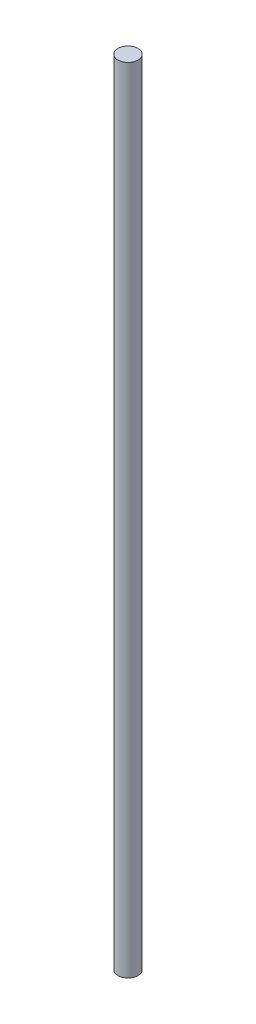
ISO-10303-21;
HEADER;
FILE_DESCRIPTION(('STEP AP214'),'2;1');
FILE_NAME('part.step','',(''),(''),'','','');
FILE_SCHEMA(('AUTOMOTIVE_DESIGN { 1 0 10303 214 1 1 1 1 }'));
ENDSEC;
DATA;
#1=APPLICATION_CONTEXT('core data for automotive mechanical design processes');
#2=APPLICATION_PROTOCOL_DEFINITION('international standard','automotive_design',2000,#1);
#3=PRODUCT_CONTEXT('',#1,'mechanical');
#4=PRODUCT('Part','Part','',(#3));
#5=PRODUCT_RELATED_PRODUCT_CATEGORY('part','',(#4));
#6=PRODUCT_DEFINITION_FORMATION('','',#4);
#7=PRODUCT_DEFINITION_CONTEXT('part definition',#1,'design');
#8=PRODUCT_DEFINITION('design','',#6,#7);
#9=PRODUCT_DEFINITION_SHAPE('','',#8);
#10=(LENGTH_UNIT() NAMED_UNIT(*) SI_UNIT(.MILLI.,.METRE.));
#11=(NAMED_UNIT(*) PLANE_ANGLE_UNIT() SI_UNIT($,.RADIAN.));
#12=(NAMED_UNIT(*) SI_UNIT($,.STERADIAN.) SOLID_ANGLE_UNIT());
#13=UNCERTAINTY_MEASURE_WITH_UNIT(LENGTH_MEASURE(1.E-05),#10,'distance_accuracy_value','');
#14=(GEOMETRIC_REPRESENTATION_CONTEXT(3) GLOBAL_UNCERTAINTY_ASSIGNED_CONTEXT((#13)) GLOBAL_UNIT_ASSIGNED_CONTEXT((#10,
#11,#12)) REPRESENTATION_CONTEXT('',''));
#15=CARTESIAN_POINT('',(0.,0.,0.));
#16=DIRECTION('',(0.,0.,1.));
#17=DIRECTION('',(1.,0.,0.));
#18=AXIS2_PLACEMENT_3D('',#15,#16,#17);
#19=CARTESIAN_POINT('',(0.,500.,0.));
#20=DIRECTION('',(0.,-1.,0.));
#21=DIRECTION('',(0.,0.,-1.));
#22=AXIS2_PLACEMENT_3D('',#19,#20,#21);
#23=CYLINDRICAL_SURFACE('',#22,6.35);
#24=CARTESIAN_POINT('',(0.,500.,0.));
#25=DIRECTION('',(0.,1.,0.));
#26=DIRECTION('',(0.,0.,1.));
#27=AXIS2_PLACEMENT_3D('',#24,#25,#26);
#28=CIRCLE('',#27,6.35);
#29=CARTESIAN_POINT('',(0.,500.,6.35));
#30=VERTEX_POINT('',#29);
#31=EDGE_CURVE('E10',#30,#30,#28,.T.);
#32=ORIENTED_EDGE('',*,*,#31,.F.);
#33=EDGE_LOOP('',(#32));
#34=FACE_BOUND('',#33,.T.);
#35=CARTESIAN_POINT('',(0.,0.,0.));
#36=DIRECTION('',(0.,1.,0.));
#37=DIRECTION('',(0.,0.,1.));
#38=AXIS2_PLACEMENT_3D('',#35,#36,#37);
#39=CIRCLE('',#38,6.35);
#40=CARTESIAN_POINT('',(0.,0.,6.35));
#41=VERTEX_POINT('',#40);
#42=EDGE_CURVE('E34',#41,#41,#39,.T.);
#43=ORIENTED_EDGE('',*,*,#42,.T.);
#44=EDGE_LOOP('',(#43));
#45=FACE_BOUND('',#44,.T.);
#46=ADVANCED_FACE('F31',(#34,#45),#23,.T.);
#47=CARTESIAN_POINT('',(0.,500.,0.));
#48=DIRECTION('',(0.,1.,0.));
#49=DIRECTION('',(0.,0.,1.));
#50=AXIS2_PLACEMENT_3D('',#47,#48,#49);
#51=PLANE('',#50);
#52=ORIENTED_EDGE('',*,*,#31,.T.);
#53=EDGE_LOOP('',(#52));
#54=FACE_BOUND('',#53,.T.);
#55=ADVANCED_FACE('F46',(#54),#51,.T.);
#56=CARTESIAN_POINT('',(0.,0.,0.));
#57=DIRECTION('',(0.,1.,0.));
#58=DIRECTION('',(0.,0.,1.));
#59=AXIS2_PLACEMENT_3D('',#56,#57,#58);
#60=PLANE('',#59);
#61=ORIENTED_EDGE('',*,*,#42,.F.);
#62=EDGE_LOOP('',(#61));
#63=FACE_BOUND('',#62,.T.);
#64=ADVANCED_FACE('F44',(#63),#60,.F.);
#65=CLOSED_SHELL('',(#46,#55,#64));
#66=MANIFOLD_SOLID_BREP('B2',#65);
#67=ADVANCED_BREP_SHAPE_REPRESENTATION('',(#18,#66),#14);
#68=SHAPE_DEFINITION_REPRESENTATION(#9,#67);
ENDSEC;
END-ISO-10303-21;
